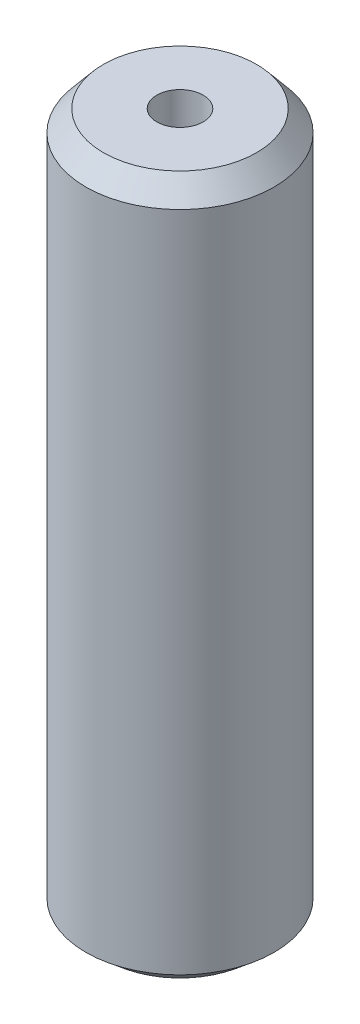
ISO-10303-21;
HEADER;
FILE_DESCRIPTION(('STEP AP214'),'2;1');
FILE_NAME('part.step','',(''),(''),'','','');
FILE_SCHEMA(('AUTOMOTIVE_DESIGN { 1 0 10303 214 1 1 1 1 }'));
ENDSEC;
DATA;
#1=APPLICATION_CONTEXT('core data for automotive mechanical design processes');
#2=APPLICATION_PROTOCOL_DEFINITION('international standard','automotive_design',2000,#1);
#3=PRODUCT_CONTEXT('',#1,'mechanical');
#4=PRODUCT('Part','Part','',(#3));
#5=PRODUCT_RELATED_PRODUCT_CATEGORY('part','',(#4));
#6=PRODUCT_DEFINITION_FORMATION('','',#4);
#7=PRODUCT_DEFINITION_CONTEXT('part definition',#1,'design');
#8=PRODUCT_DEFINITION('design','',#6,#7);
#9=PRODUCT_DEFINITION_SHAPE('','',#8);
#10=(LENGTH_UNIT() NAMED_UNIT(*) SI_UNIT(.MILLI.,.METRE.));
#11=(NAMED_UNIT(*) PLANE_ANGLE_UNIT() SI_UNIT($,.RADIAN.));
#12=(NAMED_UNIT(*) SI_UNIT($,.STERADIAN.) SOLID_ANGLE_UNIT());
#13=UNCERTAINTY_MEASURE_WITH_UNIT(LENGTH_MEASURE(1.E-05),#10,'distance_accuracy_value','');
#14=(GEOMETRIC_REPRESENTATION_CONTEXT(3) GLOBAL_UNCERTAINTY_ASSIGNED_CONTEXT((#13)) GLOBAL_UNIT_ASSIGNED_CONTEXT((#10,
#11,#12)) REPRESENTATION_CONTEXT('',''));
#15=CARTESIAN_POINT('',(0.,0.,0.));
#16=DIRECTION('',(0.,0.,1.));
#17=DIRECTION('',(1.,0.,0.));
#18=AXIS2_PLACEMENT_3D('',#15,#16,#17);
#19=CARTESIAN_POINT('',(0.,74.5188701627575,0.));
#20=DIRECTION('',(0.,-1.,0.));
#21=DIRECTION('',(0.,0.,-1.));
#22=AXIS2_PLACEMENT_3D('',#19,#20,#21);
#23=CYLINDRICAL_SURFACE('',#22,10.);
#24=CARTESIAN_POINT('',(0.,72.2891957271044,0.));
#25=DIRECTION('',(0.,1.,0.));
#26=DIRECTION('',(0.,0.,1.));
#27=AXIS2_PLACEMENT_3D('',#24,#25,#26);
#28=CIRCLE('',#27,10.);
#29=CARTESIAN_POINT('',(0.,72.2891957271044,10.));
#30=VERTEX_POINT('',#29);
#31=EDGE_CURVE('E50',#30,#30,#28,.F.);
#32=ORIENTED_EDGE('',*,*,#31,.T.);
#33=EDGE_LOOP('',(#32));
#34=FACE_BOUND('',#33,.T.);
#35=CARTESIAN_POINT('',(0.,1.86421462994715,0.));
#36=DIRECTION('',(0.,1.,0.));
#37=DIRECTION('',(0.,0.,1.));
#38=AXIS2_PLACEMENT_3D('',#35,#36,#37);
#39=CIRCLE('',#38,10.);
#40=CARTESIAN_POINT('',(0.,1.86421462994715,10.));
#41=VERTEX_POINT('',#40);
#42=EDGE_CURVE('E51',#41,#41,#39,.T.);
#43=ORIENTED_EDGE('',*,*,#42,.T.);
#44=EDGE_LOOP('',(#43));
#45=FACE_BOUND('',#44,.T.);
#46=ADVANCED_FACE('F39',(#34,#45),#23,.T.);
#47=CARTESIAN_POINT('',(0.,74.5188701627575,0.));
#48=DIRECTION('',(0.,1.,0.));
#49=DIRECTION('',(0.,0.,1.));
#50=AXIS2_PLACEMENT_3D('',#47,#48,#49);
#51=PLANE('',#50);
#52=CARTESIAN_POINT('',(0.,74.5188701627575,0.));
#53=DIRECTION('',(0.,1.,0.));
#54=DIRECTION('',(0.,0.,1.));
#55=AXIS2_PLACEMENT_3D('',#52,#53,#54);
#56=CIRCLE('',#55,8.13578537005285);
#57=CARTESIAN_POINT('',(0.,74.5188701627575,8.13578537005285));
#58=VERTEX_POINT('',#57);
#59=EDGE_CURVE('E54',#58,#58,#56,.T.);
#60=ORIENTED_EDGE('',*,*,#59,.T.);
#61=EDGE_LOOP('',(#60));
#62=FACE_BOUND('',#61,.T.);
#63=CARTESIAN_POINT('',(0.,74.5188701627575,0.));
#64=DIRECTION('',(0.,1.,0.));
#65=DIRECTION('',(0.,0.,1.));
#66=AXIS2_PLACEMENT_3D('',#63,#64,#65);
#67=CIRCLE('',#66,2.4662084434814);
#68=CARTESIAN_POINT('',(0.,74.5188701627575,2.4662084434814));
#69=VERTEX_POINT('',#68);
#70=EDGE_CURVE('E58',#69,#69,#67,.T.);
#71=ORIENTED_EDGE('',*,*,#70,.F.);
#72=EDGE_LOOP('',(#71));
#73=FACE_BOUND('',#72,.T.);
#74=ADVANCED_FACE('F69',(#62,#73),#51,.T.);
#75=CARTESIAN_POINT('',(0.,0.,0.));
#76=DIRECTION('',(0.,1.,0.));
#77=DIRECTION('',(0.,0.,1.));
#78=AXIS2_PLACEMENT_3D('',#75,#76,#77);
#79=PLANE('',#78);
#80=CARTESIAN_POINT('',(0.,0.,0.));
#81=DIRECTION('',(0.,1.,0.));
#82=DIRECTION('',(0.,0.,1.));
#83=AXIS2_PLACEMENT_3D('',#80,#81,#82);
#84=CIRCLE('',#83,7.77032556434695);
#85=CARTESIAN_POINT('',(0.,0.,7.77032556434695));
#86=VERTEX_POINT('',#85);
#87=EDGE_CURVE('E10',#86,#86,#84,.F.);
#88=ORIENTED_EDGE('',*,*,#87,.T.);
#89=EDGE_LOOP('',(#88));
#90=FACE_BOUND('',#89,.T.);
#91=CARTESIAN_POINT('',(0.,0.,0.));
#92=DIRECTION('',(0.,1.,0.));
#93=DIRECTION('',(0.,0.,1.));
#94=AXIS2_PLACEMENT_3D('',#91,#92,#93);
#95=CIRCLE('',#94,2.4662084434814);
#96=CARTESIAN_POINT('',(0.,0.,2.4662084434814));
#97=VERTEX_POINT('',#96);
#98=EDGE_CURVE('E63',#97,#97,#95,.T.);
#99=ORIENTED_EDGE('',*,*,#98,.T.);
#100=EDGE_LOOP('',(#99));
#101=FACE_BOUND('',#100,.T.);
#102=ADVANCED_FACE('F75',(#90,#101),#79,.F.);
#103=CARTESIAN_POINT('',(0.,74.5188701627575,0.));
#104=DIRECTION('',(0.,-1.,0.));
#105=DIRECTION('',(0.,0.,-1.));
#106=AXIS2_PLACEMENT_3D('',#103,#104,#105);
#107=CYLINDRICAL_SURFACE('',#106,2.4662084434814);
#108=ORIENTED_EDGE('',*,*,#70,.T.);
#109=EDGE_LOOP('',(#108));
#110=FACE_BOUND('',#109,.T.);
#111=ORIENTED_EDGE('',*,*,#98,.F.);
#112=EDGE_LOOP('',(#111));
#113=FACE_BOUND('',#112,.T.);
#114=ADVANCED_FACE('F70',(#110,#113),#107,.F.);
#115=CARTESIAN_POINT('',(0.,74.5188701627575,0.));
#116=DIRECTION('',(0.,-1.,0.));
#117=DIRECTION('',(0.,0.,-1.));
#118=AXIS2_PLACEMENT_3D('',#115,#116,#117);
#119=CONICAL_SURFACE('',#118,8.13578537005285,0.696364575773811);
#120=ORIENTED_EDGE('',*,*,#31,.F.);
#121=EDGE_LOOP('',(#120));
#122=FACE_BOUND('',#121,.T.);
#123=ORIENTED_EDGE('',*,*,#59,.F.);
#124=EDGE_LOOP('',(#123));
#125=FACE_BOUND('',#124,.T.);
#126=ADVANCED_FACE('F81',(#122,#125),#119,.T.);
#127=CARTESIAN_POINT('',(0.,1.86421462994715,0.));
#128=DIRECTION('',(0.,1.,0.));
#129=DIRECTION('',(0.,0.,1.));
#130=AXIS2_PLACEMENT_3D('',#127,#128,#129);
#131=CONICAL_SURFACE('',#130,10.,0.874431751021089);
#132=CARTESIAN_POINT('',(0.,0.,7.77032556434695));
#133=CARTESIAN_POINT('',(0.,0.0194189023952824,7.79355133971834));
#134=CARTESIAN_POINT('',(0.,0.0388378047905654,7.81677711508972));
#135=CARTESIAN_POINT('',(0.,0.0776756095811313,7.8632286658325));
#136=CARTESIAN_POINT('',(0.,0.0970945119764142,7.88645444120388));
#137=CARTESIAN_POINT('',(0.,0.13593231676698,7.93290599194665));
#138=CARTESIAN_POINT('',(0.,0.155351219162262,7.95613176731804));
#139=CARTESIAN_POINT('',(0.,0.194189023952828,8.00258331806081));
#140=CARTESIAN_POINT('',(0.,0.213607926348111,8.0258090934322));
#141=CARTESIAN_POINT('',(0.,0.252445731138677,8.07226064417497));
#142=CARTESIAN_POINT('',(0.,0.271864633533959,8.09548641954635));
#143=CARTESIAN_POINT('',(0.,0.310702438324525,8.14193797028913));
#144=CARTESIAN_POINT('',(0.,0.330121340719808,8.16516374566051));
#145=CARTESIAN_POINT('',(0.,0.368959145510374,8.21161529640328));
#146=CARTESIAN_POINT('',(0.,0.388378047905657,8.23484107177467));
#147=CARTESIAN_POINT('',(0.,0.427215852696222,8.28129262251744));
#148=CARTESIAN_POINT('',(0.,0.446634755091505,8.30451839788883));
#149=CARTESIAN_POINT('',(0.,0.485472559882071,8.3509699486316));
#150=CARTESIAN_POINT('',(0.,0.504891462277354,8.37419572400299));
#151=CARTESIAN_POINT('',(0.,0.543729267067919,8.42064727474576));
#152=CARTESIAN_POINT('',(0.,0.563148169463202,8.44387305011714));
#153=CARTESIAN_POINT('',(0.,0.601985974253768,8.49032460085992));
#154=CARTESIAN_POINT('',(0.,0.621404876649051,8.5135503762313));
#155=CARTESIAN_POINT('',(0.,0.660242681439616,8.56000192697407));
#156=CARTESIAN_POINT('',(0.,0.679661583834899,8.58322770234546));
#157=CARTESIAN_POINT('',(0.,0.718499388625465,8.62967925308823));
#158=CARTESIAN_POINT('',(0.,0.737918291020748,8.65290502845962));
#159=CARTESIAN_POINT('',(0.,0.776756095811314,8.69935657920239));
#160=CARTESIAN_POINT('',(0.,0.796174998206596,8.72258235457377));
#161=CARTESIAN_POINT('',(0.,0.835012802997162,8.76903390531655));
#162=CARTESIAN_POINT('',(0.,0.854431705392445,8.79225968068793));
#163=CARTESIAN_POINT('',(0.,0.893269510183011,8.8387112314307));
#164=CARTESIAN_POINT('',(0.,0.912688412578294,8.86193700680209));
#165=CARTESIAN_POINT('',(0.,0.951526217368859,8.90838855754486));
#166=CARTESIAN_POINT('',(0.,0.970945119764142,8.93161433291625));
#167=CARTESIAN_POINT('',(0.,1.00978292455471,8.97806588365902));
#168=CARTESIAN_POINT('',(0.,1.02920182694999,9.00129165903041));
#169=CARTESIAN_POINT('',(0.,1.06803963174056,9.04774320977318));
#170=CARTESIAN_POINT('',(0.,1.08745853413584,9.07096898514456));
#171=CARTESIAN_POINT('',(0.,1.1262963389264,9.11742053588734));
#172=CARTESIAN_POINT('',(0.,1.14571524132169,9.14064631125872));
#173=CARTESIAN_POINT('',(0.,1.18455304611225,9.18709786200149));
#174=CARTESIAN_POINT('',(0.,1.20397194850754,9.21032363737288));
#175=CARTESIAN_POINT('',(0.,1.2428097532981,9.25677518811565));
#176=CARTESIAN_POINT('',(0.,1.26222865569339,9.28000096348704));
#177=CARTESIAN_POINT('',(0.,1.30106646048395,9.32645251422981));
#178=CARTESIAN_POINT('',(0.,1.32048536287923,9.34967828960119));
#179=CARTESIAN_POINT('',(0.,1.3593231676698,9.39612984034397));
#180=CARTESIAN_POINT('',(0.,1.37874207006508,9.41935561571535));
#181=CARTESIAN_POINT('',(0.,1.41757987485565,9.46580716645813));
#182=CARTESIAN_POINT('',(0.,1.43699877725093,9.48903294182951));
#183=CARTESIAN_POINT('',(0.,1.4758365820415,9.53548449257228));
#184=CARTESIAN_POINT('',(0.,1.49525548443678,9.55871026794367));
#185=CARTESIAN_POINT('',(0.,1.53409328922734,9.60516181868644));
#186=CARTESIAN_POINT('',(0.,1.55351219162263,9.62838759405783));
#187=CARTESIAN_POINT('',(0.,1.59234999641319,9.6748391448006));
#188=CARTESIAN_POINT('',(0.,1.61176889880848,9.69806492017198));
#189=CARTESIAN_POINT('',(0.,1.65060670359904,9.74451647091476));
#190=CARTESIAN_POINT('',(0.,1.67002560599432,9.76774224628614));
#191=CARTESIAN_POINT('',(0.,1.70886341078489,9.81419379702891));
#192=CARTESIAN_POINT('',(0.,1.72828231318017,9.8374195724003));
#193=CARTESIAN_POINT('',(0.,1.76712011797074,9.88387112314307));
#194=CARTESIAN_POINT('',(0.,1.78653902036602,9.90709689851446));
#195=CARTESIAN_POINT('',(0.,1.82537682515659,9.95354844925723));
#196=CARTESIAN_POINT('',(0.,1.84479572755187,9.97677422462862));
#197=CARTESIAN_POINT('',(0.,1.86421462994715,10.));
#198=B_SPLINE_CURVE_WITH_KNOTS('',3,(#132,#133,#134,#135,#136,#137,#138,#139,#140,#141,#142,
#143,#144,#145,#146,#147,#148,#149,#150,#151,#152,#153,#154,#155,#156,#157,#158,#159,#160,#161,
#162,#163,#164,#165,#166,#167,#168,#169,#170,#171,#172,#173,#174,#175,#176,#177,#178,#179,#180,
#181,#182,#183,#184,#185,#186,#187,#188,#189,#190,#191,#192,#193,#194,#195,#196,#197),
.UNSPECIFIED.,.F.,.F.,(4,2,2,2,2,2,2,2,2,2,2,2,2,2,2,2,2,2,2,2,2,2,2,2,2,2,2,2,2,2,2,2,4),(0.,
0.0908227598488193,0.181645519697639,0.272468279546459,0.363291039395279,0.454113799244099,
0.544936559092918,0.635759318941738,0.726582078790557,0.817404838639378,0.908227598488197,
0.999050358337017,1.08987311818584,1.18069587803466,1.27151863788348,1.3623413977323,
1.45316415758112,1.54398691742994,1.63480967727876,1.72563243712757,1.81645519697639,
1.90727795682521,1.99810071667403,2.08892347652285,2.17974623637167,2.27056899622049,
2.36139175606931,2.45221451591813,2.54303727576695,2.63386003561577,2.72468279546459,
2.81550555531341,2.90632831516223),.UNSPECIFIED.);
#199=EDGE_CURVE('BSEAM45',#86,#41,#198,.T.);
#200=ORIENTED_EDGE('',*,*,#87,.F.);
#201=ORIENTED_EDGE('',*,*,#42,.F.);
#202=ORIENTED_EDGE('',*,*,#199,.T.);
#203=ORIENTED_EDGE('',*,*,#199,.F.);
#204=EDGE_LOOP('',(#200,#202,#201,#203));
#205=FACE_BOUND('',#204,.T.);
#206=ADVANCED_FACE('F45',(#205),#131,.T.);
#207=CLOSED_SHELL('',(#46,#74,#102,#114,#126,#206));
#208=MANIFOLD_SOLID_BREP('B2',#207);
#209=ADVANCED_BREP_SHAPE_REPRESENTATION('',(#18,#208),#14);
#210=SHAPE_DEFINITION_REPRESENTATION(#9,#209);
ENDSEC;
END-ISO-10303-21;
